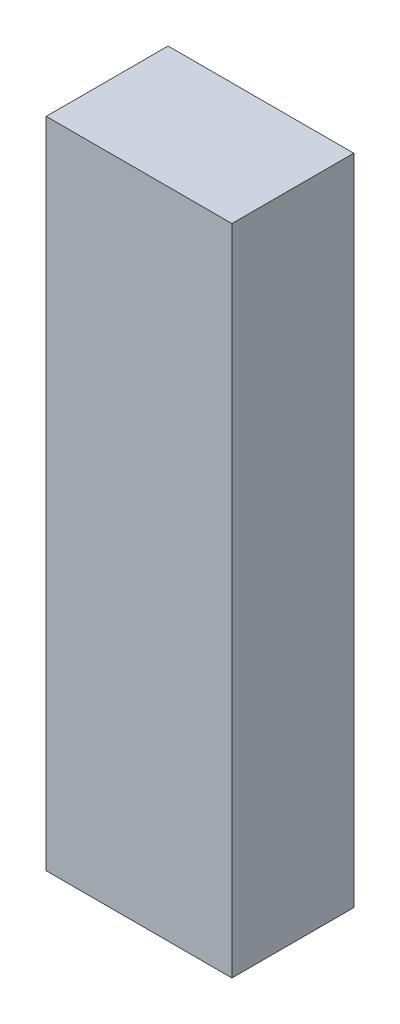
ISO-10303-21;
HEADER;
FILE_DESCRIPTION(('STEP AP214'),'2;1');
FILE_NAME('part.step','',(''),(''),'','','');
FILE_SCHEMA(('AUTOMOTIVE_DESIGN { 1 0 10303 214 1 1 1 1 }'));
ENDSEC;
DATA;
#1=APPLICATION_CONTEXT('core data for automotive mechanical design processes');
#2=APPLICATION_PROTOCOL_DEFINITION('international standard','automotive_design',2000,#1);
#3=PRODUCT_CONTEXT('',#1,'mechanical');
#4=PRODUCT('Part','Part','',(#3));
#5=PRODUCT_RELATED_PRODUCT_CATEGORY('part','',(#4));
#6=PRODUCT_DEFINITION_FORMATION('','',#4);
#7=PRODUCT_DEFINITION_CONTEXT('part definition',#1,'design');
#8=PRODUCT_DEFINITION('design','',#6,#7);
#9=PRODUCT_DEFINITION_SHAPE('','',#8);
#10=(LENGTH_UNIT() NAMED_UNIT(*) SI_UNIT(.MILLI.,.METRE.));
#11=(NAMED_UNIT(*) PLANE_ANGLE_UNIT() SI_UNIT($,.RADIAN.));
#12=(NAMED_UNIT(*) SI_UNIT($,.STERADIAN.) SOLID_ANGLE_UNIT());
#13=UNCERTAINTY_MEASURE_WITH_UNIT(LENGTH_MEASURE(1.E-05),#10,'distance_accuracy_value','');
#14=(GEOMETRIC_REPRESENTATION_CONTEXT(3) GLOBAL_UNCERTAINTY_ASSIGNED_CONTEXT((#13)) GLOBAL_UNIT_ASSIGNED_CONTEXT((#10,
#11,#12)) REPRESENTATION_CONTEXT('',''));
#15=CARTESIAN_POINT('',(0.,0.,0.));
#16=DIRECTION('',(0.,0.,1.));
#17=DIRECTION('',(1.,0.,0.));
#18=AXIS2_PLACEMENT_3D('',#15,#16,#17);
#19=CARTESIAN_POINT('',(24.003,-84.455,31.496));
#20=DIRECTION('',(0.,1.,0.));
#21=DIRECTION('',(0.,0.,1.));
#22=AXIS2_PLACEMENT_3D('',#19,#20,#21);
#23=PLANE('',#22);
#24=DIRECTION('',(1.,0.,0.));
#25=VECTOR('',#24,1.);
#26=CARTESIAN_POINT('',(24.003,-84.455,0.));
#27=LINE('',#26,#25);
#28=CARTESIAN_POINT('',(-24.003,-84.455,0.));
#29=VERTEX_POINT('',#28);
#30=CARTESIAN_POINT('',(24.003,-84.455,0.));
#31=VERTEX_POINT('',#30);
#32=EDGE_CURVE('E113',#29,#31,#27,.T.);
#33=ORIENTED_EDGE('',*,*,#32,.T.);
#34=DIRECTION('',(0.,0.,-1.));
#35=VECTOR('',#34,1.);
#36=CARTESIAN_POINT('',(24.003,-84.455,31.496));
#37=LINE('',#36,#35);
#38=CARTESIAN_POINT('',(24.003,-84.455,31.496));
#39=VERTEX_POINT('',#38);
#40=EDGE_CURVE('E11',#39,#31,#37,.T.);
#41=ORIENTED_EDGE('',*,*,#40,.F.);
#42=DIRECTION('',(1.,0.,0.));
#43=VECTOR('',#42,1.);
#44=CARTESIAN_POINT('',(24.003,-84.455,31.496));
#45=LINE('',#44,#43);
#46=CARTESIAN_POINT('',(-24.003,-84.455,31.496));
#47=VERTEX_POINT('',#46);
#48=EDGE_CURVE('E97',#47,#39,#45,.T.);
#49=ORIENTED_EDGE('',*,*,#48,.F.);
#50=DIRECTION('',(0.,0.,-1.));
#51=VECTOR('',#50,1.);
#52=CARTESIAN_POINT('',(-24.003,-84.455,31.496));
#53=LINE('',#52,#51);
#54=EDGE_CURVE('E109',#47,#29,#53,.T.);
#55=ORIENTED_EDGE('',*,*,#54,.T.);
#56=EDGE_LOOP('',(#33,#41,#49,#55));
#57=FACE_BOUND('',#56,.T.);
#58=ADVANCED_FACE('F45',(#57),#23,.F.);
#59=CARTESIAN_POINT('',(24.003,84.455,31.496));
#60=DIRECTION('',(-1.,0.,0.));
#61=DIRECTION('',(0.,-1.,0.));
#62=AXIS2_PLACEMENT_3D('',#59,#60,#61);
#63=PLANE('',#62);
#64=DIRECTION('',(0.,1.,0.));
#65=VECTOR('',#64,1.);
#66=CARTESIAN_POINT('',(24.003,84.455,0.));
#67=LINE('',#66,#65);
#68=CARTESIAN_POINT('',(24.003,84.455,0.));
#69=VERTEX_POINT('',#68);
#70=EDGE_CURVE('E102',#31,#69,#67,.T.);
#71=ORIENTED_EDGE('',*,*,#70,.T.);
#72=DIRECTION('',(0.,0.,-1.));
#73=VECTOR('',#72,1.);
#74=CARTESIAN_POINT('',(24.003,84.455,31.496));
#75=LINE('',#74,#73);
#76=CARTESIAN_POINT('',(24.003,84.455,31.496));
#77=VERTEX_POINT('',#76);
#78=EDGE_CURVE('E54',#77,#69,#75,.T.);
#79=ORIENTED_EDGE('',*,*,#78,.F.);
#80=DIRECTION('',(0.,1.,0.));
#81=VECTOR('',#80,1.);
#82=CARTESIAN_POINT('',(24.003,84.455,31.496));
#83=LINE('',#82,#81);
#84=EDGE_CURVE('E92',#39,#77,#83,.T.);
#85=ORIENTED_EDGE('',*,*,#84,.F.);
#86=ORIENTED_EDGE('',*,*,#40,.T.);
#87=EDGE_LOOP('',(#71,#79,#85,#86));
#88=FACE_BOUND('',#87,.T.);
#89=ADVANCED_FACE('F101',(#88),#63,.F.);
#90=CARTESIAN_POINT('',(24.003,84.455,31.496));
#91=DIRECTION('',(0.,-1.,0.));
#92=DIRECTION('',(0.,0.,-1.));
#93=AXIS2_PLACEMENT_3D('',#90,#91,#92);
#94=PLANE('',#93);
#95=DIRECTION('',(-1.,0.,0.));
#96=VECTOR('',#95,1.);
#97=CARTESIAN_POINT('',(24.003,84.455,0.));
#98=LINE('',#97,#96);
#99=CARTESIAN_POINT('',(-24.003,84.455,0.));
#100=VERTEX_POINT('',#99);
#101=EDGE_CURVE('E79',#69,#100,#98,.T.);
#102=ORIENTED_EDGE('',*,*,#101,.T.);
#103=DIRECTION('',(0.,0.,-1.));
#104=VECTOR('',#103,1.);
#105=CARTESIAN_POINT('',(-24.003,84.455,31.496));
#106=LINE('',#105,#104);
#107=CARTESIAN_POINT('',(-24.003,84.455,31.496));
#108=VERTEX_POINT('',#107);
#109=EDGE_CURVE('E104',#108,#100,#106,.T.);
#110=ORIENTED_EDGE('',*,*,#109,.F.);
#111=DIRECTION('',(-1.,0.,0.));
#112=VECTOR('',#111,1.);
#113=CARTESIAN_POINT('',(24.003,84.455,31.496));
#114=LINE('',#113,#112);
#115=EDGE_CURVE('E95',#77,#108,#114,.T.);
#116=ORIENTED_EDGE('',*,*,#115,.F.);
#117=ORIENTED_EDGE('',*,*,#78,.T.);
#118=EDGE_LOOP('',(#102,#110,#116,#117));
#119=FACE_BOUND('',#118,.T.);
#120=ADVANCED_FACE('F105',(#119),#94,.F.);
#121=CARTESIAN_POINT('',(-24.003,84.455,31.496));
#122=DIRECTION('',(1.,0.,0.));
#123=DIRECTION('',(0.,1.,0.));
#124=AXIS2_PLACEMENT_3D('',#121,#122,#123);
#125=PLANE('',#124);
#126=DIRECTION('',(0.,-1.,0.));
#127=VECTOR('',#126,1.);
#128=CARTESIAN_POINT('',(-24.003,84.455,0.));
#129=LINE('',#128,#127);
#130=EDGE_CURVE('E85',#100,#29,#129,.T.);
#131=ORIENTED_EDGE('',*,*,#130,.T.);
#132=ORIENTED_EDGE('',*,*,#54,.F.);
#133=DIRECTION('',(0.,-1.,0.));
#134=VECTOR('',#133,1.);
#135=CARTESIAN_POINT('',(-24.003,84.455,31.496));
#136=LINE('',#135,#134);
#137=EDGE_CURVE('E62',#108,#47,#136,.T.);
#138=ORIENTED_EDGE('',*,*,#137,.F.);
#139=ORIENTED_EDGE('',*,*,#109,.T.);
#140=EDGE_LOOP('',(#131,#132,#138,#139));
#141=FACE_BOUND('',#140,.T.);
#142=ADVANCED_FACE('F126',(#141),#125,.F.);
#143=CARTESIAN_POINT('',(0.,0.,31.496));
#144=DIRECTION('',(0.,0.,1.));
#145=DIRECTION('',(1.,0.,0.));
#146=AXIS2_PLACEMENT_3D('',#143,#144,#145);
#147=PLANE('',#146);
#148=ORIENTED_EDGE('',*,*,#48,.T.);
#149=ORIENTED_EDGE('',*,*,#84,.T.);
#150=ORIENTED_EDGE('',*,*,#115,.T.);
#151=ORIENTED_EDGE('',*,*,#137,.T.);
#152=EDGE_LOOP('',(#148,#149,#150,#151));
#153=FACE_BOUND('',#152,.T.);
#154=ADVANCED_FACE('F93',(#153),#147,.T.);
#155=CARTESIAN_POINT('',(0.,0.,0.));
#156=DIRECTION('',(0.,0.,1.));
#157=DIRECTION('',(1.,0.,0.));
#158=AXIS2_PLACEMENT_3D('',#155,#156,#157);
#159=PLANE('',#158);
#160=ORIENTED_EDGE('',*,*,#32,.F.);
#161=ORIENTED_EDGE('',*,*,#130,.F.);
#162=ORIENTED_EDGE('',*,*,#101,.F.);
#163=ORIENTED_EDGE('',*,*,#70,.F.);
#164=EDGE_LOOP('',(#160,#161,#162,#163));
#165=FACE_BOUND('',#164,.T.);
#166=ADVANCED_FACE('F129',(#165),#159,.F.);
#167=CLOSED_SHELL('',(#58,#89,#120,#142,#154,#166));
#168=MANIFOLD_SOLID_BREP('B2',#167);
#169=ADVANCED_BREP_SHAPE_REPRESENTATION('',(#18,#168),#14);
#170=SHAPE_DEFINITION_REPRESENTATION(#9,#169);
ENDSEC;
END-ISO-10303-21;
